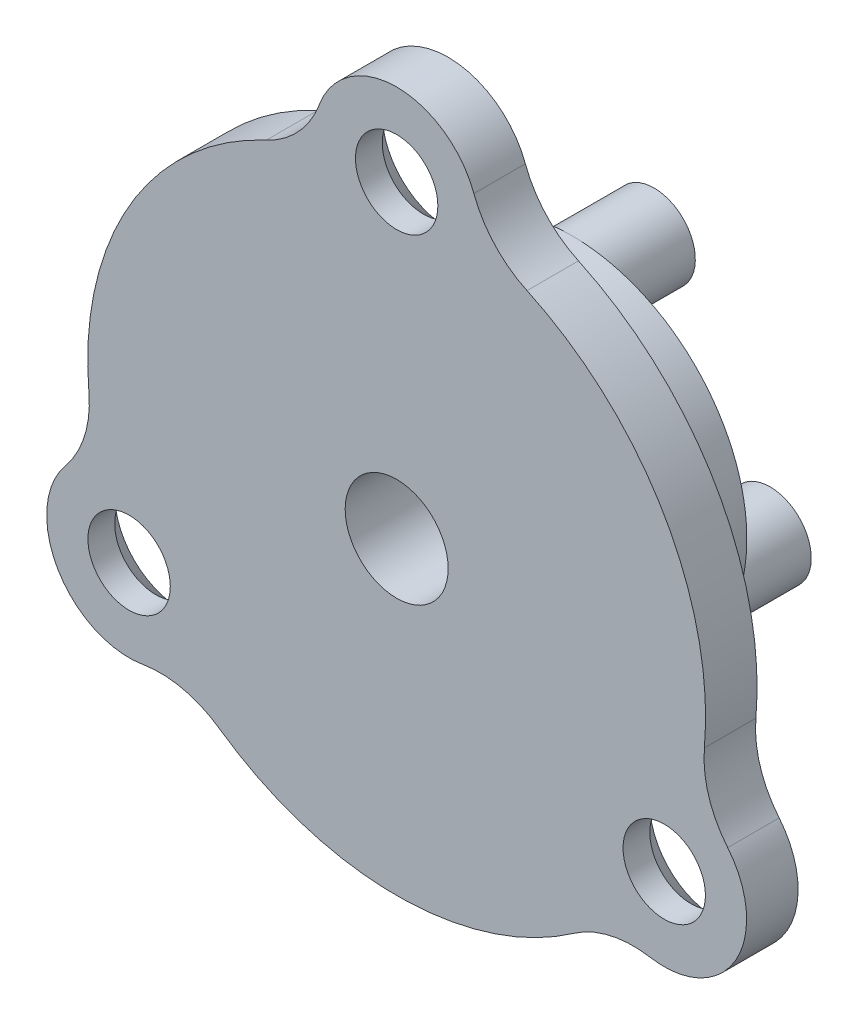
ISO-10303-21;
HEADER;
FILE_DESCRIPTION(('STEP AP214'),'2;1');
FILE_NAME('part.step','',(''),(''),'','','');
FILE_SCHEMA(('AUTOMOTIVE_DESIGN { 1 0 10303 214 1 1 1 1 }'));
ENDSEC;
DATA;
#1=APPLICATION_CONTEXT('core data for automotive mechanical design processes');
#2=APPLICATION_PROTOCOL_DEFINITION('international standard','automotive_design',2000,#1);
#3=PRODUCT_CONTEXT('',#1,'mechanical');
#4=PRODUCT('Part','Part','',(#3));
#5=PRODUCT_RELATED_PRODUCT_CATEGORY('part','',(#4));
#6=PRODUCT_DEFINITION_FORMATION('','',#4);
#7=PRODUCT_DEFINITION_CONTEXT('part definition',#1,'design');
#8=PRODUCT_DEFINITION('design','',#6,#7);
#9=PRODUCT_DEFINITION_SHAPE('','',#8);
#10=(LENGTH_UNIT() NAMED_UNIT(*) SI_UNIT(.MILLI.,.METRE.));
#11=(NAMED_UNIT(*) PLANE_ANGLE_UNIT() SI_UNIT($,.RADIAN.));
#12=(NAMED_UNIT(*) SI_UNIT($,.STERADIAN.) SOLID_ANGLE_UNIT());
#13=UNCERTAINTY_MEASURE_WITH_UNIT(LENGTH_MEASURE(1.E-05),#10,'distance_accuracy_value','');
#14=(GEOMETRIC_REPRESENTATION_CONTEXT(3) GLOBAL_UNCERTAINTY_ASSIGNED_CONTEXT((#13)) GLOBAL_UNIT_ASSIGNED_CONTEXT((#10,
#11,#12)) REPRESENTATION_CONTEXT('',''));
#15=CARTESIAN_POINT('',(0.,0.,0.));
#16=DIRECTION('',(0.,0.,1.));
#17=DIRECTION('',(1.,0.,0.));
#18=AXIS2_PLACEMENT_3D('',#15,#16,#17);
#19=CARTESIAN_POINT('',(0.,0.,0.));
#20=DIRECTION('',(0.,0.,1.));
#21=DIRECTION('',(1.,0.,0.));
#22=AXIS2_PLACEMENT_3D('',#19,#20,#21);
#23=PLANE('',#22);
#24=CARTESIAN_POINT('',(0.,0.,0.));
#25=DIRECTION('',(0.,0.,1.));
#26=DIRECTION('',(1.,0.,0.));
#27=AXIS2_PLACEMENT_3D('',#24,#25,#26);
#28=CIRCLE('',#27,9.25);
#29=CARTESIAN_POINT('',(9.25,0.,0.));
#30=VERTEX_POINT('',#29);
#31=EDGE_CURVE('E207',#30,#30,#28,.F.);
#32=ORIENTED_EDGE('',*,*,#31,.F.);
#33=EDGE_LOOP('',(#32));
#34=FACE_BOUND('',#33,.T.);
#35=CARTESIAN_POINT('',(0.,15.,0.));
#36=DIRECTION('',(0.,0.,1.));
#37=DIRECTION('',(1.,0.,0.));
#38=AXIS2_PLACEMENT_3D('',#35,#36,#37);
#39=CIRCLE('',#38,3.19999999999999);
#40=CARTESIAN_POINT('',(3.19999999999999,15.,0.));
#41=VERTEX_POINT('',#40);
#42=EDGE_CURVE('E210',#41,#41,#39,.T.);
#43=ORIENTED_EDGE('',*,*,#42,.T.);
#44=EDGE_LOOP('',(#43));
#45=FACE_BOUND('',#44,.T.);
#46=CARTESIAN_POINT('',(-12.9903810567647,-7.50000000000111,0.));
#47=DIRECTION('',(0.,0.,1.));
#48=DIRECTION('',(1.,0.,0.));
#49=AXIS2_PLACEMENT_3D('',#46,#47,#48);
#50=CIRCLE('',#49,3.19999999999999);
#51=CARTESIAN_POINT('',(-9.79038105676468,-7.50000000000111,0.));
#52=VERTEX_POINT('',#51);
#53=EDGE_CURVE('E213',#52,#52,#50,.T.);
#54=ORIENTED_EDGE('',*,*,#53,.T.);
#55=EDGE_LOOP('',(#54));
#56=FACE_BOUND('',#55,.T.);
#57=CARTESIAN_POINT('',(12.9903810567685,-7.49999999999889,0.));
#58=DIRECTION('',(0.,0.,1.));
#59=DIRECTION('',(1.,0.,0.));
#60=AXIS2_PLACEMENT_3D('',#57,#58,#59);
#61=CIRCLE('',#60,3.2);
#62=CARTESIAN_POINT('',(9.7903810567685,-7.49999999999889,0.));
#63=VERTEX_POINT('',#62);
#64=EDGE_CURVE('E216',#63,#63,#61,.T.);
#65=ORIENTED_EDGE('',*,*,#64,.T.);
#66=EDGE_LOOP('',(#65));
#67=FACE_BOUND('',#66,.T.);
#68=CARTESIAN_POINT('',(0.,15.,0.));
#69=DIRECTION('',(0.,0.,-1.));
#70=DIRECTION('',(-1.,0.,0.));
#71=AXIS2_PLACEMENT_3D('',#68,#69,#70);
#72=CIRCLE('',#71,4.);
#73=CARTESIAN_POINT('',(-3.74975810833929,16.3925925925926,0.));
#74=VERTEX_POINT('',#73);
#75=CARTESIAN_POINT('',(3.74975810833929,16.3925925925926,0.));
#76=VERTEX_POINT('',#75);
#77=EDGE_CURVE('E301',#74,#76,#72,.T.);
#78=ORIENTED_EDGE('',*,*,#77,.T.);
#79=CARTESIAN_POINT('',(8.4369557437634,18.1333333333333,0.));
#80=DIRECTION('',(0.,0.,1.));
#81=DIRECTION('',(1.,0.,0.));
#82=AXIS2_PLACEMENT_3D('',#79,#80,#81);
#83=CIRCLE('',#82,5.);
#84=CARTESIAN_POINT('',(6.32771680782255,13.6,0.));
#85=VERTEX_POINT('',#84);
#86=EDGE_CURVE('E279',#76,#85,#83,.T.);
#87=ORIENTED_EDGE('',*,*,#86,.T.);
#88=CARTESIAN_POINT('',(0.,0.,0.));
#89=DIRECTION('',(0.,0.,-1.));
#90=DIRECTION('',(-1.,0.,0.));
#91=AXIS2_PLACEMENT_3D('',#88,#89,#90);
#92=CIRCLE('',#91,15.);
#93=CARTESIAN_POINT('',(14.9418038953797,-1.32003649647074,0.));
#94=VERTEX_POINT('',#93);
#95=EDGE_CURVE('E402',#85,#94,#92,.T.);
#96=ORIENTED_EDGE('',*,*,#95,.T.);
#97=CARTESIAN_POINT('',(19.9224051938397,-1.76004866196099,0.));
#98=DIRECTION('',(0.,0.,1.));
#99=DIRECTION('',(1.,0.,0.));
#100=AXIS2_PLACEMENT_3D('',#97,#98,#99);
#101=CIRCLE('',#100,5.);
#102=CARTESIAN_POINT('',(16.0712806732441,-4.94891051642688,0.));
#103=VERTEX_POINT('',#102);
#104=EDGE_CURVE('E275',#94,#103,#101,.T.);
#105=ORIENTED_EDGE('',*,*,#104,.T.);
#106=CARTESIAN_POINT('',(12.9903810567685,-7.49999999999889,0.));
#107=DIRECTION('',(0.,0.,-1.));
#108=DIRECTION('',(-1.,0.,0.));
#109=AXIS2_PLACEMENT_3D('',#106,#107,#108);
#110=CIRCLE('',#109,3.99999999999889);
#111=CARTESIAN_POINT('',(12.3215225649066,-11.4436820761627,0.));
#112=VERTEX_POINT('',#111);
#113=EDGE_CURVE('E406',#103,#112,#110,.T.);
#114=ORIENTED_EDGE('',*,*,#113,.T.);
#115=CARTESIAN_POINT('',(11.4854494500791,-16.3732846713687,0.));
#116=DIRECTION('',(0.,0.,1.));
#117=DIRECTION('',(1.,0.,0.));
#118=AXIS2_PLACEMENT_3D('',#115,#116,#117);
#119=CIRCLE('',#118,5.);
#120=CARTESIAN_POINT('',(8.6140870875593,-12.2799635035266,0.));
#121=VERTEX_POINT('',#120);
#122=EDGE_CURVE('E271',#112,#121,#119,.T.);
#123=ORIENTED_EDGE('',*,*,#122,.T.);
#124=CARTESIAN_POINT('',(0.,0.,0.));
#125=DIRECTION('',(0.,0.,-1.));
#126=DIRECTION('',(-1.,0.,0.));
#127=AXIS2_PLACEMENT_3D('',#124,#125,#126);
#128=CIRCLE('',#127,15.);
#129=CARTESIAN_POINT('',(-8.61408708755489,-12.2799635035296,0.));
#130=VERTEX_POINT('',#129);
#131=EDGE_CURVE('E410',#121,#130,#128,.T.);
#132=ORIENTED_EDGE('',*,*,#131,.T.);
#133=CARTESIAN_POINT('',(-11.4854494500732,-16.3732846713729,0.));
#134=DIRECTION('',(0.,0.,1.));
#135=DIRECTION('',(1.,0.,0.));
#136=AXIS2_PLACEMENT_3D('',#133,#134,#135);
#137=CIRCLE('',#136,5.);
#138=CARTESIAN_POINT('',(-12.3215225649017,-11.4436820761669,0.));
#139=VERTEX_POINT('',#138);
#140=EDGE_CURVE('E267',#130,#139,#137,.T.);
#141=ORIENTED_EDGE('',*,*,#140,.T.);
#142=CARTESIAN_POINT('',(-12.9903810567647,-7.50000000000111,0.));
#143=DIRECTION('',(0.,0.,-1.));
#144=DIRECTION('',(-1.,0.,0.));
#145=AXIS2_PLACEMENT_3D('',#142,#143,#144);
#146=CIRCLE('',#145,4.0000000000011);
#147=CARTESIAN_POINT('',(-16.0712806732428,-4.94891051642869,0.));
#148=VERTEX_POINT('',#147);
#149=EDGE_CURVE('E293',#139,#148,#146,.T.);
#150=ORIENTED_EDGE('',*,*,#149,.T.);
#151=CARTESIAN_POINT('',(-19.9224051938394,-1.76004866196405,0.));
#152=DIRECTION('',(0.,0.,1.));
#153=DIRECTION('',(1.,0.,0.));
#154=AXIS2_PLACEMENT_3D('',#151,#152,#153);
#155=CIRCLE('',#154,5.);
#156=CARTESIAN_POINT('',(-14.9418038953795,-1.32003649647304,0.));
#157=VERTEX_POINT('',#156);
#158=EDGE_CURVE('E91',#148,#157,#155,.T.);
#159=ORIENTED_EDGE('',*,*,#158,.T.);
#160=CARTESIAN_POINT('',(0.,0.,0.));
#161=DIRECTION('',(0.,0.,-1.));
#162=DIRECTION('',(-1.,0.,0.));
#163=AXIS2_PLACEMENT_3D('',#160,#161,#162);
#164=CIRCLE('',#163,15.);
#165=CARTESIAN_POINT('',(-6.32771680782255,13.6,0.));
#166=VERTEX_POINT('',#165);
#167=EDGE_CURVE('E291',#157,#166,#164,.T.);
#168=ORIENTED_EDGE('',*,*,#167,.T.);
#169=CARTESIAN_POINT('',(-8.4369557437634,18.1333333333333,0.));
#170=DIRECTION('',(0.,0.,1.));
#171=DIRECTION('',(1.,0.,0.));
#172=AXIS2_PLACEMENT_3D('',#169,#170,#171);
#173=CIRCLE('',#172,5.);
#174=EDGE_CURVE('E283',#166,#74,#173,.T.);
#175=ORIENTED_EDGE('',*,*,#174,.T.);
#176=EDGE_LOOP('',(#78,#87,#96,#105,#114,#123,#132,#141,#150,#159,#168,#175));
#177=FACE_BOUND('',#176,.T.);
#178=ADVANCED_FACE('F83',(#34,#45,#56,#67,#177),#23,.F.);
#179=CARTESIAN_POINT('',(0.,0.,2.5));
#180=DIRECTION('',(0.,0.,1.));
#181=DIRECTION('',(1.,0.,0.));
#182=AXIS2_PLACEMENT_3D('',#179,#180,#181);
#183=PLANE('',#182);
#184=CARTESIAN_POINT('',(12.9903810567685,-7.49999999999889,2.5));
#185=DIRECTION('',(0.,0.,1.));
#186=DIRECTION('',(1.,0.,0.));
#187=AXIS2_PLACEMENT_3D('',#184,#185,#186);
#188=CIRCLE('',#187,2.);
#189=CARTESIAN_POINT('',(14.9903810567685,-7.49999999999889,2.5));
#190=VERTEX_POINT('',#189);
#191=EDGE_CURVE('E194',#190,#190,#188,.T.);
#192=ORIENTED_EDGE('',*,*,#191,.F.);
#193=EDGE_LOOP('',(#192));
#194=FACE_BOUND('',#193,.T.);
#195=CARTESIAN_POINT('',(0.,0.,2.5));
#196=DIRECTION('',(0.,0.,1.));
#197=DIRECTION('',(1.,0.,0.));
#198=AXIS2_PLACEMENT_3D('',#195,#196,#197);
#199=CIRCLE('',#198,2.5);
#200=CARTESIAN_POINT('',(2.5,0.,2.5));
#201=VERTEX_POINT('',#200);
#202=EDGE_CURVE('E204',#201,#201,#199,.T.);
#203=ORIENTED_EDGE('',*,*,#202,.F.);
#204=EDGE_LOOP('',(#203));
#205=FACE_BOUND('',#204,.T.);
#206=CARTESIAN_POINT('',(0.,15.,2.5));
#207=DIRECTION('',(0.,0.,1.));
#208=DIRECTION('',(1.,0.,0.));
#209=AXIS2_PLACEMENT_3D('',#206,#207,#208);
#210=CIRCLE('',#209,2.);
#211=CARTESIAN_POINT('',(2.,15.,2.5));
#212=VERTEX_POINT('',#211);
#213=EDGE_CURVE('E201',#212,#212,#210,.T.);
#214=ORIENTED_EDGE('',*,*,#213,.F.);
#215=EDGE_LOOP('',(#214));
#216=FACE_BOUND('',#215,.T.);
#217=CARTESIAN_POINT('',(-12.9903810567647,-7.50000000000111,2.5));
#218=DIRECTION('',(0.,0.,1.));
#219=DIRECTION('',(1.,0.,0.));
#220=AXIS2_PLACEMENT_3D('',#217,#218,#219);
#221=CIRCLE('',#220,2.);
#222=CARTESIAN_POINT('',(-10.9903810567647,-7.50000000000111,2.5));
#223=VERTEX_POINT('',#222);
#224=EDGE_CURVE('E192',#223,#223,#221,.T.);
#225=ORIENTED_EDGE('',*,*,#224,.F.);
#226=EDGE_LOOP('',(#225));
#227=FACE_BOUND('',#226,.T.);
#228=CARTESIAN_POINT('',(0.,0.,2.5));
#229=DIRECTION('',(0.,0.,1.));
#230=DIRECTION('',(1.,0.,0.));
#231=AXIS2_PLACEMENT_3D('',#228,#229,#230);
#232=CIRCLE('',#231,15.);
#233=CARTESIAN_POINT('',(-8.61408708755489,-12.2799635035296,2.5));
#234=VERTEX_POINT('',#233);
#235=CARTESIAN_POINT('',(8.6140870875593,-12.2799635035266,2.5));
#236=VERTEX_POINT('',#235);
#237=EDGE_CURVE('E231',#234,#236,#232,.T.);
#238=ORIENTED_EDGE('',*,*,#237,.T.);
#239=CARTESIAN_POINT('',(11.4854494500791,-16.3732846713687,2.5));
#240=DIRECTION('',(0.,0.,1.));
#241=DIRECTION('',(1.,0.,0.));
#242=AXIS2_PLACEMENT_3D('',#239,#240,#241);
#243=CIRCLE('',#242,5.);
#244=CARTESIAN_POINT('',(12.3215225649066,-11.4436820761627,2.5));
#245=VERTEX_POINT('',#244);
#246=EDGE_CURVE('E273',#236,#245,#243,.F.);
#247=ORIENTED_EDGE('',*,*,#246,.T.);
#248=CARTESIAN_POINT('',(12.9903810567685,-7.49999999999889,2.5));
#249=DIRECTION('',(0.,0.,1.));
#250=DIRECTION('',(1.,0.,0.));
#251=AXIS2_PLACEMENT_3D('',#248,#249,#250);
#252=CIRCLE('',#251,3.99999999999889);
#253=CARTESIAN_POINT('',(16.0712806732441,-4.94891051642688,2.5));
#254=VERTEX_POINT('',#253);
#255=EDGE_CURVE('E417',#245,#254,#252,.T.);
#256=ORIENTED_EDGE('',*,*,#255,.T.);
#257=CARTESIAN_POINT('',(19.9224051938397,-1.76004866196099,2.5));
#258=DIRECTION('',(0.,0.,1.));
#259=DIRECTION('',(1.,0.,0.));
#260=AXIS2_PLACEMENT_3D('',#257,#258,#259);
#261=CIRCLE('',#260,5.);
#262=CARTESIAN_POINT('',(14.9418038953797,-1.32003649647074,2.5));
#263=VERTEX_POINT('',#262);
#264=EDGE_CURVE('E277',#254,#263,#261,.F.);
#265=ORIENTED_EDGE('',*,*,#264,.T.);
#266=CARTESIAN_POINT('',(0.,0.,2.5));
#267=DIRECTION('',(0.,0.,1.));
#268=DIRECTION('',(1.,0.,0.));
#269=AXIS2_PLACEMENT_3D('',#266,#267,#268);
#270=CIRCLE('',#269,15.);
#271=CARTESIAN_POINT('',(6.32771680782255,13.6,2.5));
#272=VERTEX_POINT('',#271);
#273=EDGE_CURVE('E234',#263,#272,#270,.T.);
#274=ORIENTED_EDGE('',*,*,#273,.T.);
#275=CARTESIAN_POINT('',(8.4369557437634,18.1333333333333,2.5));
#276=DIRECTION('',(0.,0.,1.));
#277=DIRECTION('',(1.,0.,0.));
#278=AXIS2_PLACEMENT_3D('',#275,#276,#277);
#279=CIRCLE('',#278,5.);
#280=CARTESIAN_POINT('',(3.74975810833929,16.3925925925926,2.5));
#281=VERTEX_POINT('',#280);
#282=EDGE_CURVE('E281',#272,#281,#279,.F.);
#283=ORIENTED_EDGE('',*,*,#282,.T.);
#284=CARTESIAN_POINT('',(0.,15.,2.5));
#285=DIRECTION('',(0.,0.,1.));
#286=DIRECTION('',(1.,0.,0.));
#287=AXIS2_PLACEMENT_3D('',#284,#285,#286);
#288=CIRCLE('',#287,4.);
#289=CARTESIAN_POINT('',(-3.74975810833929,16.3925925925926,2.5));
#290=VERTEX_POINT('',#289);
#291=EDGE_CURVE('E313',#281,#290,#288,.T.);
#292=ORIENTED_EDGE('',*,*,#291,.T.);
#293=CARTESIAN_POINT('',(-8.4369557437634,18.1333333333333,2.5));
#294=DIRECTION('',(0.,0.,1.));
#295=DIRECTION('',(1.,0.,0.));
#296=AXIS2_PLACEMENT_3D('',#293,#294,#295);
#297=CIRCLE('',#296,5.);
#298=CARTESIAN_POINT('',(-6.32771680782255,13.6,2.5));
#299=VERTEX_POINT('',#298);
#300=EDGE_CURVE('E285',#290,#299,#297,.F.);
#301=ORIENTED_EDGE('',*,*,#300,.T.);
#302=CARTESIAN_POINT('',(0.,0.,2.5));
#303=DIRECTION('',(0.,0.,1.));
#304=DIRECTION('',(1.,0.,0.));
#305=AXIS2_PLACEMENT_3D('',#302,#303,#304);
#306=CIRCLE('',#305,15.);
#307=CARTESIAN_POINT('',(-14.9418038953795,-1.32003649647304,2.5));
#308=VERTEX_POINT('',#307);
#309=EDGE_CURVE('E228',#299,#308,#306,.T.);
#310=ORIENTED_EDGE('',*,*,#309,.T.);
#311=CARTESIAN_POINT('',(-19.9224051938394,-1.76004866196405,2.5));
#312=DIRECTION('',(0.,0.,1.));
#313=DIRECTION('',(1.,0.,0.));
#314=AXIS2_PLACEMENT_3D('',#311,#312,#313);
#315=CIRCLE('',#314,5.);
#316=CARTESIAN_POINT('',(-16.0712806732428,-4.94891051642869,2.5));
#317=VERTEX_POINT('',#316);
#318=EDGE_CURVE('E12',#308,#317,#315,.F.);
#319=ORIENTED_EDGE('',*,*,#318,.T.);
#320=CARTESIAN_POINT('',(-12.9903810567647,-7.50000000000111,2.5));
#321=DIRECTION('',(0.,0.,1.));
#322=DIRECTION('',(1.,0.,0.));
#323=AXIS2_PLACEMENT_3D('',#320,#321,#322);
#324=CIRCLE('',#323,4.0000000000011);
#325=CARTESIAN_POINT('',(-12.3215225649017,-11.4436820761669,2.5));
#326=VERTEX_POINT('',#325);
#327=EDGE_CURVE('E308',#317,#326,#324,.T.);
#328=ORIENTED_EDGE('',*,*,#327,.T.);
#329=CARTESIAN_POINT('',(-11.4854494500732,-16.3732846713729,2.5));
#330=DIRECTION('',(0.,0.,1.));
#331=DIRECTION('',(1.,0.,0.));
#332=AXIS2_PLACEMENT_3D('',#329,#330,#331);
#333=CIRCLE('',#332,5.);
#334=EDGE_CURVE('E269',#326,#234,#333,.F.);
#335=ORIENTED_EDGE('',*,*,#334,.T.);
#336=EDGE_LOOP('',(#238,#247,#256,#265,#274,#283,#292,#301,#310,#319,#328,#335));
#337=FACE_BOUND('',#336,.T.);
#338=ADVANCED_FACE('F307',(#194,#205,#216,#227,#337),#183,.T.);
#339=CARTESIAN_POINT('',(0.,0.,2.5));
#340=DIRECTION('',(0.,0.,-1.));
#341=DIRECTION('',(-1.,0.,0.));
#342=AXIS2_PLACEMENT_3D('',#339,#340,#341);
#343=CYLINDRICAL_SURFACE('',#342,2.5);
#344=ORIENTED_EDGE('',*,*,#202,.T.);
#345=EDGE_LOOP('',(#344));
#346=FACE_BOUND('',#345,.T.);
#347=CARTESIAN_POINT('',(0.,0.,-6.));
#348=DIRECTION('',(0.,0.,-1.));
#349=DIRECTION('',(-1.,0.,0.));
#350=AXIS2_PLACEMENT_3D('',#347,#348,#349);
#351=CIRCLE('',#350,2.5);
#352=CARTESIAN_POINT('',(-2.5,0.,-6.));
#353=VERTEX_POINT('',#352);
#354=EDGE_CURVE('E188',#353,#353,#351,.T.);
#355=ORIENTED_EDGE('',*,*,#354,.T.);
#356=EDGE_LOOP('',(#355));
#357=FACE_BOUND('',#356,.T.);
#358=ADVANCED_FACE('F328',(#346,#357),#343,.F.);
#359=CARTESIAN_POINT('',(0.,15.,2.5));
#360=DIRECTION('',(0.,0.,-1.));
#361=DIRECTION('',(-1.,0.,0.));
#362=AXIS2_PLACEMENT_3D('',#359,#360,#361);
#363=CYLINDRICAL_SURFACE('',#362,2.);
#364=CARTESIAN_POINT('',(0.,15.,1.19999999999999));
#365=DIRECTION('',(0.,0.,1.));
#366=DIRECTION('',(1.,0.,0.));
#367=AXIS2_PLACEMENT_3D('',#364,#365,#366);
#368=CIRCLE('',#367,2.);
#369=CARTESIAN_POINT('',(2.,15.,1.19999999999999));
#370=VERTEX_POINT('',#369);
#371=EDGE_CURVE('E225',#370,#370,#368,.F.);
#372=ORIENTED_EDGE('',*,*,#371,.T.);
#373=EDGE_LOOP('',(#372));
#374=FACE_BOUND('',#373,.T.);
#375=ORIENTED_EDGE('',*,*,#213,.T.);
#376=EDGE_LOOP('',(#375));
#377=FACE_BOUND('',#376,.T.);
#378=ADVANCED_FACE('F660',(#374,#377),#363,.F.);
#379=CARTESIAN_POINT('',(12.9903810567685,-7.49999999999889,2.5));
#380=DIRECTION('',(0.,0.,-1.));
#381=DIRECTION('',(-1.,0.,0.));
#382=AXIS2_PLACEMENT_3D('',#379,#380,#381);
#383=CYLINDRICAL_SURFACE('',#382,2.);
#384=CARTESIAN_POINT('',(12.9903810567685,-7.49999999999889,1.2));
#385=DIRECTION('',(0.,0.,1.));
#386=DIRECTION('',(1.,0.,0.));
#387=AXIS2_PLACEMENT_3D('',#384,#385,#386);
#388=CIRCLE('',#387,2.);
#389=CARTESIAN_POINT('',(10.9903810567685,-7.49999999999889,1.2));
#390=VERTEX_POINT('',#389);
#391=EDGE_CURVE('E219',#390,#390,#388,.F.);
#392=ORIENTED_EDGE('',*,*,#391,.T.);
#393=EDGE_LOOP('',(#392));
#394=FACE_BOUND('',#393,.T.);
#395=ORIENTED_EDGE('',*,*,#191,.T.);
#396=EDGE_LOOP('',(#395));
#397=FACE_BOUND('',#396,.T.);
#398=ADVANCED_FACE('F339',(#394,#397),#383,.F.);
#399=CARTESIAN_POINT('',(-12.9903810567647,-7.50000000000111,2.5));
#400=DIRECTION('',(0.,0.,-1.));
#401=DIRECTION('',(-1.,0.,0.));
#402=AXIS2_PLACEMENT_3D('',#399,#400,#401);
#403=CYLINDRICAL_SURFACE('',#402,2.);
#404=CARTESIAN_POINT('',(-12.9903810567647,-7.50000000000111,1.2));
#405=DIRECTION('',(0.,0.,1.));
#406=DIRECTION('',(1.,0.,0.));
#407=AXIS2_PLACEMENT_3D('',#404,#405,#406);
#408=CIRCLE('',#407,2.);
#409=CARTESIAN_POINT('',(-10.9903810567647,-7.50000000000111,1.2));
#410=VERTEX_POINT('',#409);
#411=EDGE_CURVE('E222',#410,#410,#408,.F.);
#412=ORIENTED_EDGE('',*,*,#411,.T.);
#413=EDGE_LOOP('',(#412));
#414=FACE_BOUND('',#413,.T.);
#415=ORIENTED_EDGE('',*,*,#224,.T.);
#416=EDGE_LOOP('',(#415));
#417=FACE_BOUND('',#416,.T.);
#418=ADVANCED_FACE('F330',(#414,#417),#403,.F.);
#419=CARTESIAN_POINT('',(0.,0.,-6.));
#420=DIRECTION('',(0.,0.,-1.));
#421=DIRECTION('',(-1.,0.,0.));
#422=AXIS2_PLACEMENT_3D('',#419,#420,#421);
#423=PLANE('',#422);
#424=CARTESIAN_POINT('',(0.,0.,-6.));
#425=DIRECTION('',(0.,0.,-1.));
#426=DIRECTION('',(-1.,0.,0.));
#427=AXIS2_PLACEMENT_3D('',#424,#425,#426);
#428=CIRCLE('',#427,8.5);
#429=CARTESIAN_POINT('',(0.,8.5,-6.));
#430=VERTEX_POINT('',#429);
#431=CARTESIAN_POINT('',(7.36121593216773,-4.25,-6.));
#432=VERTEX_POINT('',#431);
#433=EDGE_CURVE('E190',#430,#432,#428,.T.);
#434=ORIENTED_EDGE('',*,*,#433,.T.);
#435=CARTESIAN_POINT('',(5.62916512459885,-3.25,-6.));
#436=DIRECTION('',(0.,0.,-1.));
#437=DIRECTION('',(-1.,0.,0.));
#438=AXIS2_PLACEMENT_3D('',#435,#436,#437);
#439=CIRCLE('',#438,2.);
#440=EDGE_CURVE('E96',#432,#432,#439,.T.);
#441=ORIENTED_EDGE('',*,*,#440,.F.);
#442=CARTESIAN_POINT('',(-7.36121593216773,-4.25,-6.));
#443=VERTEX_POINT('',#442);
#444=EDGE_CURVE('E102',#432,#443,#428,.T.);
#445=ORIENTED_EDGE('',*,*,#444,.T.);
#446=CARTESIAN_POINT('',(-5.62916512459885,-3.25,-6.));
#447=DIRECTION('',(0.,0.,-1.));
#448=DIRECTION('',(-1.,0.,0.));
#449=AXIS2_PLACEMENT_3D('',#446,#447,#448);
#450=CIRCLE('',#449,2.);
#451=EDGE_CURVE('E186',#443,#443,#450,.T.);
#452=ORIENTED_EDGE('',*,*,#451,.F.);
#453=EDGE_CURVE('E179',#443,#430,#428,.T.);
#454=ORIENTED_EDGE('',*,*,#453,.T.);
#455=CARTESIAN_POINT('',(0.,6.5,-6.));
#456=DIRECTION('',(0.,0.,-1.));
#457=DIRECTION('',(-1.,0.,0.));
#458=AXIS2_PLACEMENT_3D('',#455,#456,#457);
#459=CIRCLE('',#458,2.);
#460=EDGE_CURVE('E185',#430,#430,#459,.T.);
#461=ORIENTED_EDGE('',*,*,#460,.F.);
#462=EDGE_LOOP('',(#434,#441,#445,#452,#454,#461));
#463=FACE_BOUND('',#462,.T.);
#464=ORIENTED_EDGE('',*,*,#354,.F.);
#465=EDGE_LOOP('',(#464));
#466=FACE_BOUND('',#465,.T.);
#467=ADVANCED_FACE('F182',(#463,#466),#423,.T.);
#468=CARTESIAN_POINT('',(0.,0.,-6.));
#469=DIRECTION('',(0.,0.,1.));
#470=DIRECTION('',(1.,0.,0.));
#471=AXIS2_PLACEMENT_3D('',#468,#469,#470);
#472=CYLINDRICAL_SURFACE('',#471,8.5);
#473=CARTESIAN_POINT('',(0.,0.,-0.5));
#474=DIRECTION('',(0.,0.,-1.));
#475=DIRECTION('',(-1.,0.,0.));
#476=AXIS2_PLACEMENT_3D('',#473,#474,#475);
#477=CIRCLE('',#476,8.5);
#478=CARTESIAN_POINT('',(-8.5,0.,-0.5));
#479=VERTEX_POINT('',#478);
#480=EDGE_CURVE('E316',#479,#479,#477,.T.);
#481=ORIENTED_EDGE('',*,*,#480,.T.);
#482=EDGE_LOOP('',(#481));
#483=FACE_BOUND('',#482,.T.);
#484=ORIENTED_EDGE('',*,*,#433,.F.);
#485=ORIENTED_EDGE('',*,*,#453,.F.);
#486=ORIENTED_EDGE('',*,*,#444,.F.);
#487=EDGE_LOOP('',(#484,#485,#486));
#488=FACE_BOUND('',#487,.T.);
#489=ADVANCED_FACE('F191',(#483,#488),#472,.T.);
#490=CARTESIAN_POINT('',(0.,0.,-0.5));
#491=DIRECTION('',(0.,0.,-1.));
#492=DIRECTION('',(-1.,0.,0.));
#493=AXIS2_PLACEMENT_3D('',#490,#491,#492);
#494=PLANE('',#493);
#495=CARTESIAN_POINT('',(0.,0.,-0.5));
#496=DIRECTION('',(0.,0.,-1.));
#497=DIRECTION('',(-1.,0.,0.));
#498=AXIS2_PLACEMENT_3D('',#495,#496,#497);
#499=CIRCLE('',#498,9.25);
#500=CARTESIAN_POINT('',(-9.25,0.,-0.5));
#501=VERTEX_POINT('',#500);
#502=EDGE_CURVE('E321',#501,#501,#499,.T.);
#503=ORIENTED_EDGE('',*,*,#502,.T.);
#504=EDGE_LOOP('',(#503));
#505=FACE_BOUND('',#504,.T.);
#506=ORIENTED_EDGE('',*,*,#480,.F.);
#507=EDGE_LOOP('',(#506));
#508=FACE_BOUND('',#507,.T.);
#509=ADVANCED_FACE('F336',(#505,#508),#494,.T.);
#510=CARTESIAN_POINT('',(0.,0.,-0.5));
#511=DIRECTION('',(0.,0.,1.));
#512=DIRECTION('',(1.,0.,0.));
#513=AXIS2_PLACEMENT_3D('',#510,#511,#512);
#514=CYLINDRICAL_SURFACE('',#513,9.25);
#515=ORIENTED_EDGE('',*,*,#502,.F.);
#516=EDGE_LOOP('',(#515));
#517=FACE_BOUND('',#516,.T.);
#518=ORIENTED_EDGE('',*,*,#31,.T.);
#519=EDGE_LOOP('',(#518));
#520=FACE_BOUND('',#519,.T.);
#521=ADVANCED_FACE('F359',(#517,#520),#514,.T.);
#522=CARTESIAN_POINT('',(12.9903810567685,-7.49999999999889,0.));
#523=DIRECTION('',(0.,0.,-1.));
#524=DIRECTION('',(-1.,0.,0.));
#525=AXIS2_PLACEMENT_3D('',#522,#523,#524);
#526=CONICAL_SURFACE('',#525,3.2,0.785398163397447);
#527=CARTESIAN_POINT('',(10.9903810567685,-7.49999999999889,1.2));
#528=CARTESIAN_POINT('',(10.9778810567685,-7.49999999999889,1.1875));
#529=CARTESIAN_POINT('',(10.9653810567685,-7.49999999999889,1.175));
#530=CARTESIAN_POINT('',(10.9403810567685,-7.49999999999889,1.15));
#531=CARTESIAN_POINT('',(10.9278810567685,-7.49999999999889,1.1375));
#532=CARTESIAN_POINT('',(10.9028810567685,-7.49999999999889,1.1125));
#533=CARTESIAN_POINT('',(10.8903810567685,-7.49999999999889,1.1));
#534=CARTESIAN_POINT('',(10.8653810567685,-7.49999999999889,1.075));
#535=CARTESIAN_POINT('',(10.8528810567685,-7.49999999999889,1.0625));
#536=CARTESIAN_POINT('',(10.8278810567685,-7.49999999999889,1.0375));
#537=CARTESIAN_POINT('',(10.8153810567685,-7.49999999999889,1.025));
#538=CARTESIAN_POINT('',(10.7903810567685,-7.49999999999889,1.));
#539=CARTESIAN_POINT('',(10.7778810567685,-7.49999999999889,0.987500000000004));
#540=CARTESIAN_POINT('',(10.7528810567685,-7.49999999999889,0.962500000000003));
#541=CARTESIAN_POINT('',(10.7403810567685,-7.49999999999889,0.950000000000004));
#542=CARTESIAN_POINT('',(10.7153810567685,-7.49999999999889,0.925000000000003));
#543=CARTESIAN_POINT('',(10.7028810567685,-7.49999999999889,0.912500000000003));
#544=CARTESIAN_POINT('',(10.6778810567685,-7.49999999999889,0.887500000000003));
#545=CARTESIAN_POINT('',(10.6653810567685,-7.49999999999889,0.875000000000003));
#546=CARTESIAN_POINT('',(10.6403810567685,-7.49999999999889,0.850000000000003));
#547=CARTESIAN_POINT('',(10.6278810567685,-7.49999999999889,0.837500000000003));
#548=CARTESIAN_POINT('',(10.6028810567685,-7.49999999999889,0.812500000000003));
#549=CARTESIAN_POINT('',(10.5903810567685,-7.49999999999889,0.800000000000003));
#550=CARTESIAN_POINT('',(10.5653810567685,-7.49999999999889,0.775000000000003));
#551=CARTESIAN_POINT('',(10.5528810567685,-7.49999999999889,0.762500000000003));
#552=CARTESIAN_POINT('',(10.5278810567685,-7.49999999999889,0.737500000000003));
#553=CARTESIAN_POINT('',(10.5153810567685,-7.49999999999889,0.725000000000003));
#554=CARTESIAN_POINT('',(10.4903810567685,-7.49999999999889,0.700000000000002));
#555=CARTESIAN_POINT('',(10.4778810567685,-7.49999999999889,0.687500000000002));
#556=CARTESIAN_POINT('',(10.4528810567685,-7.49999999999889,0.662500000000002));
#557=CARTESIAN_POINT('',(10.4403810567685,-7.49999999999889,0.650000000000002));
#558=CARTESIAN_POINT('',(10.4153810567685,-7.49999999999889,0.625000000000002));
#559=CARTESIAN_POINT('',(10.4028810567685,-7.49999999999889,0.612500000000002));
#560=CARTESIAN_POINT('',(10.3778810567685,-7.49999999999889,0.587500000000002));
#561=CARTESIAN_POINT('',(10.3653810567685,-7.49999999999889,0.575000000000002));
#562=CARTESIAN_POINT('',(10.3403810567685,-7.49999999999889,0.550000000000002));
#563=CARTESIAN_POINT('',(10.3278810567685,-7.49999999999889,0.537500000000002));
#564=CARTESIAN_POINT('',(10.3028810567685,-7.49999999999889,0.512500000000002));
#565=CARTESIAN_POINT('',(10.2903810567685,-7.49999999999889,0.500000000000002));
#566=CARTESIAN_POINT('',(10.2653810567685,-7.49999999999889,0.475000000000002));
#567=CARTESIAN_POINT('',(10.2528810567685,-7.49999999999889,0.462500000000002));
#568=CARTESIAN_POINT('',(10.2278810567685,-7.49999999999889,0.437500000000002));
#569=CARTESIAN_POINT('',(10.2153810567685,-7.49999999999889,0.425000000000002));
#570=CARTESIAN_POINT('',(10.1903810567685,-7.49999999999889,0.400000000000002));
#571=CARTESIAN_POINT('',(10.1778810567685,-7.49999999999889,0.387500000000002));
#572=CARTESIAN_POINT('',(10.1528810567685,-7.49999999999889,0.362500000000001));
#573=CARTESIAN_POINT('',(10.1403810567685,-7.49999999999889,0.350000000000001));
#574=CARTESIAN_POINT('',(10.1153810567685,-7.49999999999889,0.325000000000001));
#575=CARTESIAN_POINT('',(10.1028810567685,-7.49999999999889,0.312500000000001));
#576=CARTESIAN_POINT('',(10.0778810567685,-7.49999999999889,0.287500000000001));
#577=CARTESIAN_POINT('',(10.0653810567685,-7.49999999999889,0.275000000000001));
#578=CARTESIAN_POINT('',(10.0403810567685,-7.49999999999889,0.250000000000001));
#579=CARTESIAN_POINT('',(10.0278810567685,-7.49999999999889,0.237500000000001));
#580=CARTESIAN_POINT('',(10.0028810567685,-7.49999999999889,0.212500000000001));
#581=CARTESIAN_POINT('',(9.9903810567685,-7.49999999999889,0.200000000000001));
#582=CARTESIAN_POINT('',(9.9653810567685,-7.49999999999889,0.175));
#583=CARTESIAN_POINT('',(9.9528810567685,-7.49999999999889,0.1625));
#584=CARTESIAN_POINT('',(9.9278810567685,-7.49999999999889,0.1375));
#585=CARTESIAN_POINT('',(9.9153810567685,-7.49999999999889,0.125000000000001));
#586=CARTESIAN_POINT('',(9.8903810567685,-7.49999999999889,0.1));
#587=CARTESIAN_POINT('',(9.8778810567685,-7.49999999999889,0.0875000000000001));
#588=CARTESIAN_POINT('',(9.8528810567685,-7.49999999999889,0.0625));
#589=CARTESIAN_POINT('',(9.8403810567685,-7.49999999999889,0.0500000000000002));
#590=CARTESIAN_POINT('',(9.8153810567685,-7.49999999999889,0.0250000000000005));
#591=CARTESIAN_POINT('',(9.80288105676849,-7.49999999999889,0.0125000000000006));
#592=CARTESIAN_POINT('',(9.7903810567685,-7.49999999999889,0.));
#593=B_SPLINE_CURVE_WITH_KNOTS('',3,(#527,#528,#529,#530,#531,#532,#533,#534,#535,#536,#537,
#538,#539,#540,#541,#542,#543,#544,#545,#546,#547,#548,#549,#550,#551,#552,#553,#554,#555,#556,
#557,#558,#559,#560,#561,#562,#563,#564,#565,#566,#567,#568,#569,#570,#571,#572,#573,#574,#575,
#576,#577,#578,#579,#580,#581,#582,#583,#584,#585,#586,#587,#588,#589,#590,#591,#592),
.UNSPECIFIED.,.F.,.F.,(4,2,2,2,2,2,2,2,2,2,2,2,2,2,2,2,2,2,2,2,2,2,2,2,2,2,2,2,2,2,2,2,4),(0.,
0.053033008588992,0.106066017177984,0.159099025766975,0.212132034355965,0.265165042944956,
0.318198051533948,0.37123106012294,0.42426406871193,0.477297077300921,0.530330085889913,
0.583363094478904,0.636396103067896,0.689429111656886,0.742462120245877,0.795495128834869,
0.84852813742386,0.901561146012852,0.954594154601842,1.00762716319083,1.06066017177982,
1.11369318036882,1.16672618895781,1.2197591975468,1.27279220613579,1.32582521472478,
1.37885822331377,1.43189123190276,1.48492424049175,1.53795724908075,1.59099025766974,
1.64402326625873,1.69705627484772),.UNSPECIFIED.);
#594=EDGE_CURVE('BSEAM355',#390,#63,#593,.T.);
#595=ORIENTED_EDGE('',*,*,#391,.F.);
#596=ORIENTED_EDGE('',*,*,#64,.F.);
#597=ORIENTED_EDGE('',*,*,#594,.T.);
#598=ORIENTED_EDGE('',*,*,#594,.F.);
#599=EDGE_LOOP('',(#595,#597,#596,#598));
#600=FACE_BOUND('',#599,.T.);
#601=ADVANCED_FACE('F355',(#600),#526,.F.);
#602=CARTESIAN_POINT('',(-12.9903810567647,-7.50000000000111,0.));
#603=DIRECTION('',(0.,0.,-1.));
#604=DIRECTION('',(-1.,0.,0.));
#605=AXIS2_PLACEMENT_3D('',#602,#603,#604);
#606=CONICAL_SURFACE('',#605,3.19999999999999,0.785398163397444);
#607=ORIENTED_EDGE('',*,*,#411,.F.);
#608=EDGE_LOOP('',(#607));
#609=FACE_BOUND('',#608,.T.);
#610=ORIENTED_EDGE('',*,*,#53,.F.);
#611=EDGE_LOOP('',(#610));
#612=FACE_BOUND('',#611,.T.);
#613=ADVANCED_FACE('F358',(#609,#612),#606,.F.);
#614=CARTESIAN_POINT('',(0.,15.,0.));
#615=DIRECTION('',(0.,0.,-1.));
#616=DIRECTION('',(-1.,0.,0.));
#617=AXIS2_PLACEMENT_3D('',#614,#615,#616);
#618=CONICAL_SURFACE('',#617,3.19999999999999,0.785398163397449);
#619=ORIENTED_EDGE('',*,*,#371,.F.);
#620=EDGE_LOOP('',(#619));
#621=FACE_BOUND('',#620,.T.);
#622=ORIENTED_EDGE('',*,*,#42,.F.);
#623=EDGE_LOOP('',(#622));
#624=FACE_BOUND('',#623,.T.);
#625=ADVANCED_FACE('F363',(#621,#624),#618,.F.);
#626=CARTESIAN_POINT('',(0.,15.,10.));
#627=DIRECTION('',(0.,0.,-1.));
#628=DIRECTION('',(-1.,0.,0.));
#629=AXIS2_PLACEMENT_3D('',#626,#627,#628);
#630=CYLINDRICAL_SURFACE('',#629,4.);
#631=ORIENTED_EDGE('',*,*,#291,.F.);
#632=DIRECTION('',(0.,0.,-1.));
#633=VECTOR('',#632,1.);
#634=CARTESIAN_POINT('',(3.74975810833929,16.3925925925926,10.));
#635=LINE('',#634,#633);
#636=EDGE_CURVE('E259',#281,#76,#635,.T.);
#637=ORIENTED_EDGE('',*,*,#636,.T.);
#638=ORIENTED_EDGE('',*,*,#77,.F.);
#639=DIRECTION('',(0.,0.,-1.));
#640=VECTOR('',#639,1.);
#641=CARTESIAN_POINT('',(-3.74975810833929,16.3925925925926,10.));
#642=LINE('',#641,#640);
#643=EDGE_CURVE('E257',#74,#290,#642,.F.);
#644=ORIENTED_EDGE('',*,*,#643,.T.);
#645=EDGE_LOOP('',(#631,#637,#638,#644));
#646=FACE_BOUND('',#645,.T.);
#647=ADVANCED_FACE('F367',(#646),#630,.T.);
#648=CARTESIAN_POINT('',(-12.9903810567647,-7.50000000000111,10.));
#649=DIRECTION('',(0.,0.,-1.));
#650=DIRECTION('',(-1.,0.,0.));
#651=AXIS2_PLACEMENT_3D('',#648,#649,#650);
#652=CYLINDRICAL_SURFACE('',#651,4.0000000000011);
#653=ORIENTED_EDGE('',*,*,#149,.F.);
#654=DIRECTION('',(0.,0.,-1.));
#655=VECTOR('',#654,1.);
#656=CARTESIAN_POINT('',(-12.3215225649017,-11.4436820761669,10.));
#657=LINE('',#656,#655);
#658=EDGE_CURVE('E245',#139,#326,#657,.F.);
#659=ORIENTED_EDGE('',*,*,#658,.T.);
#660=ORIENTED_EDGE('',*,*,#327,.F.);
#661=DIRECTION('',(0.,0.,-1.));
#662=VECTOR('',#661,1.);
#663=CARTESIAN_POINT('',(-16.0712806732428,-4.94891051642869,10.));
#664=LINE('',#663,#662);
#665=EDGE_CURVE('E242',#317,#148,#664,.T.);
#666=ORIENTED_EDGE('',*,*,#665,.T.);
#667=EDGE_LOOP('',(#653,#659,#660,#666));
#668=FACE_BOUND('',#667,.T.);
#669=ADVANCED_FACE('F311',(#668),#652,.T.);
#670=CARTESIAN_POINT('',(0.,0.,10.));
#671=DIRECTION('',(0.,0.,-1.));
#672=DIRECTION('',(-1.,0.,0.));
#673=AXIS2_PLACEMENT_3D('',#670,#671,#672);
#674=CYLINDRICAL_SURFACE('',#673,15.);
#675=ORIENTED_EDGE('',*,*,#309,.F.);
#676=DIRECTION('',(0.,0.,-1.));
#677=VECTOR('',#676,1.);
#678=CARTESIAN_POINT('',(-6.32771680782255,13.6,10.));
#679=LINE('',#678,#677);
#680=EDGE_CURVE('E264',#299,#166,#679,.T.);
#681=ORIENTED_EDGE('',*,*,#680,.T.);
#682=ORIENTED_EDGE('',*,*,#167,.F.);
#683=DIRECTION('',(0.,0.,-1.));
#684=VECTOR('',#683,1.);
#685=CARTESIAN_POINT('',(-14.9418038953795,-1.32003649647304,10.));
#686=LINE('',#685,#684);
#687=EDGE_CURVE('E262',#157,#308,#686,.F.);
#688=ORIENTED_EDGE('',*,*,#687,.T.);
#689=EDGE_LOOP('',(#675,#681,#682,#688));
#690=FACE_BOUND('',#689,.T.);
#691=ADVANCED_FACE('F299',(#690),#674,.T.);
#692=CARTESIAN_POINT('',(12.9903810567685,-7.49999999999889,10.));
#693=DIRECTION('',(0.,0.,-1.));
#694=DIRECTION('',(-1.,0.,0.));
#695=AXIS2_PLACEMENT_3D('',#692,#693,#694);
#696=CYLINDRICAL_SURFACE('',#695,3.99999999999889);
#697=ORIENTED_EDGE('',*,*,#255,.F.);
#698=DIRECTION('',(0.,0.,-1.));
#699=VECTOR('',#698,1.);
#700=CARTESIAN_POINT('',(12.3215225649066,-11.4436820761627,10.));
#701=LINE('',#700,#699);
#702=EDGE_CURVE('E249',#245,#112,#701,.T.);
#703=ORIENTED_EDGE('',*,*,#702,.T.);
#704=ORIENTED_EDGE('',*,*,#113,.F.);
#705=DIRECTION('',(0.,0.,-1.));
#706=VECTOR('',#705,1.);
#707=CARTESIAN_POINT('',(16.0712806732441,-4.94891051642688,10.));
#708=LINE('',#707,#706);
#709=EDGE_CURVE('E247',#103,#254,#708,.F.);
#710=ORIENTED_EDGE('',*,*,#709,.T.);
#711=EDGE_LOOP('',(#697,#703,#704,#710));
#712=FACE_BOUND('',#711,.T.);
#713=ADVANCED_FACE('F428',(#712),#696,.T.);
#714=CARTESIAN_POINT('',(0.,0.,10.));
#715=DIRECTION('',(0.,0.,-1.));
#716=DIRECTION('',(-1.,0.,0.));
#717=AXIS2_PLACEMENT_3D('',#714,#715,#716);
#718=CYLINDRICAL_SURFACE('',#717,15.);
#719=ORIENTED_EDGE('',*,*,#237,.F.);
#720=DIRECTION('',(0.,0.,-1.));
#721=VECTOR('',#720,1.);
#722=CARTESIAN_POINT('',(-8.61408708755489,-12.2799635035296,10.));
#723=LINE('',#722,#721);
#724=EDGE_CURVE('E239',#234,#130,#723,.T.);
#725=ORIENTED_EDGE('',*,*,#724,.T.);
#726=ORIENTED_EDGE('',*,*,#131,.F.);
#727=DIRECTION('',(0.,0.,-1.));
#728=VECTOR('',#727,1.);
#729=CARTESIAN_POINT('',(8.6140870875593,-12.2799635035266,10.));
#730=LINE('',#729,#728);
#731=EDGE_CURVE('E237',#121,#236,#730,.F.);
#732=ORIENTED_EDGE('',*,*,#731,.T.);
#733=EDGE_LOOP('',(#719,#725,#726,#732));
#734=FACE_BOUND('',#733,.T.);
#735=ADVANCED_FACE('F433',(#734),#718,.T.);
#736=CARTESIAN_POINT('',(0.,0.,10.));
#737=DIRECTION('',(0.,0.,-1.));
#738=DIRECTION('',(-1.,0.,0.));
#739=AXIS2_PLACEMENT_3D('',#736,#737,#738);
#740=CYLINDRICAL_SURFACE('',#739,15.);
#741=ORIENTED_EDGE('',*,*,#273,.F.);
#742=DIRECTION('',(0.,0.,-1.));
#743=VECTOR('',#742,1.);
#744=CARTESIAN_POINT('',(14.9418038953797,-1.32003649647074,10.));
#745=LINE('',#744,#743);
#746=EDGE_CURVE('E254',#263,#94,#745,.T.);
#747=ORIENTED_EDGE('',*,*,#746,.T.);
#748=ORIENTED_EDGE('',*,*,#95,.F.);
#749=DIRECTION('',(0.,0.,-1.));
#750=VECTOR('',#749,1.);
#751=CARTESIAN_POINT('',(6.32771680782255,13.6,10.));
#752=LINE('',#751,#750);
#753=EDGE_CURVE('E252',#85,#272,#752,.F.);
#754=ORIENTED_EDGE('',*,*,#753,.T.);
#755=EDGE_LOOP('',(#741,#747,#748,#754));
#756=FACE_BOUND('',#755,.T.);
#757=ADVANCED_FACE('F373',(#756),#740,.T.);
#758=CARTESIAN_POINT('',(-11.4854494500732,-16.3732846713729,10.));
#759=DIRECTION('',(0.,0.,1.));
#760=DIRECTION('',(1.,0.,0.));
#761=AXIS2_PLACEMENT_3D('',#758,#759,#760);
#762=CYLINDRICAL_SURFACE('',#761,5.);
#763=ORIENTED_EDGE('',*,*,#334,.F.);
#764=ORIENTED_EDGE('',*,*,#658,.F.);
#765=ORIENTED_EDGE('',*,*,#140,.F.);
#766=ORIENTED_EDGE('',*,*,#724,.F.);
#767=EDGE_LOOP('',(#763,#764,#765,#766));
#768=FACE_BOUND('',#767,.T.);
#769=ADVANCED_FACE('F369',(#768),#762,.F.);
#770=CARTESIAN_POINT('',(11.4854494500791,-16.3732846713687,10.));
#771=DIRECTION('',(0.,0.,1.));
#772=DIRECTION('',(1.,0.,0.));
#773=AXIS2_PLACEMENT_3D('',#770,#771,#772);
#774=CYLINDRICAL_SURFACE('',#773,5.);
#775=ORIENTED_EDGE('',*,*,#246,.F.);
#776=ORIENTED_EDGE('',*,*,#731,.F.);
#777=ORIENTED_EDGE('',*,*,#122,.F.);
#778=ORIENTED_EDGE('',*,*,#702,.F.);
#779=EDGE_LOOP('',(#775,#776,#777,#778));
#780=FACE_BOUND('',#779,.T.);
#781=ADVANCED_FACE('F372',(#780),#774,.F.);
#782=CARTESIAN_POINT('',(19.9224051938397,-1.76004866196099,10.));
#783=DIRECTION('',(0.,0.,1.));
#784=DIRECTION('',(1.,0.,0.));
#785=AXIS2_PLACEMENT_3D('',#782,#783,#784);
#786=CYLINDRICAL_SURFACE('',#785,5.);
#787=ORIENTED_EDGE('',*,*,#264,.F.);
#788=ORIENTED_EDGE('',*,*,#709,.F.);
#789=ORIENTED_EDGE('',*,*,#104,.F.);
#790=ORIENTED_EDGE('',*,*,#746,.F.);
#791=EDGE_LOOP('',(#787,#788,#789,#790));
#792=FACE_BOUND('',#791,.T.);
#793=ADVANCED_FACE('F377',(#792),#786,.F.);
#794=CARTESIAN_POINT('',(8.4369557437634,18.1333333333333,10.));
#795=DIRECTION('',(0.,0.,1.));
#796=DIRECTION('',(1.,0.,0.));
#797=AXIS2_PLACEMENT_3D('',#794,#795,#796);
#798=CYLINDRICAL_SURFACE('',#797,5.);
#799=ORIENTED_EDGE('',*,*,#282,.F.);
#800=ORIENTED_EDGE('',*,*,#753,.F.);
#801=ORIENTED_EDGE('',*,*,#86,.F.);
#802=ORIENTED_EDGE('',*,*,#636,.F.);
#803=EDGE_LOOP('',(#799,#800,#801,#802));
#804=FACE_BOUND('',#803,.T.);
#805=ADVANCED_FACE('F381',(#804),#798,.F.);
#806=CARTESIAN_POINT('',(-8.4369557437634,18.1333333333333,10.));
#807=DIRECTION('',(0.,0.,1.));
#808=DIRECTION('',(1.,0.,0.));
#809=AXIS2_PLACEMENT_3D('',#806,#807,#808);
#810=CYLINDRICAL_SURFACE('',#809,5.);
#811=ORIENTED_EDGE('',*,*,#300,.F.);
#812=ORIENTED_EDGE('',*,*,#643,.F.);
#813=ORIENTED_EDGE('',*,*,#174,.F.);
#814=ORIENTED_EDGE('',*,*,#680,.F.);
#815=EDGE_LOOP('',(#811,#812,#813,#814));
#816=FACE_BOUND('',#815,.T.);
#817=ADVANCED_FACE('F384',(#816),#810,.F.);
#818=CARTESIAN_POINT('',(-19.9224051938394,-1.76004866196405,10.));
#819=DIRECTION('',(0.,0.,1.));
#820=DIRECTION('',(1.,0.,0.));
#821=AXIS2_PLACEMENT_3D('',#818,#819,#820);
#822=CYLINDRICAL_SURFACE('',#821,5.);
#823=ORIENTED_EDGE('',*,*,#318,.F.);
#824=ORIENTED_EDGE('',*,*,#687,.F.);
#825=ORIENTED_EDGE('',*,*,#158,.F.);
#826=ORIENTED_EDGE('',*,*,#665,.F.);
#827=EDGE_LOOP('',(#823,#824,#825,#826));
#828=FACE_BOUND('',#827,.T.);
#829=ADVANCED_FACE('F85',(#828),#822,.F.);
#830=CARTESIAN_POINT('',(0.,6.5,-10.));
#831=DIRECTION('',(0.,0.,1.));
#832=DIRECTION('',(1.,0.,0.));
#833=AXIS2_PLACEMENT_3D('',#830,#831,#832);
#834=CYLINDRICAL_SURFACE('',#833,2.);
#835=CARTESIAN_POINT('',(0.,6.5,-10.));
#836=DIRECTION('',(0.,0.,-1.));
#837=DIRECTION('',(-1.,0.,0.));
#838=AXIS2_PLACEMENT_3D('',#835,#836,#837);
#839=CIRCLE('',#838,2.);
#840=CARTESIAN_POINT('',(-2.,6.5,-10.));
#841=VERTEX_POINT('',#840);
#842=EDGE_CURVE('E407',#841,#841,#839,.T.);
#843=ORIENTED_EDGE('',*,*,#842,.F.);
#844=EDGE_LOOP('',(#843));
#845=FACE_BOUND('',#844,.T.);
#846=ORIENTED_EDGE('',*,*,#460,.T.);
#847=EDGE_LOOP('',(#846));
#848=FACE_BOUND('',#847,.T.);
#849=ADVANCED_FACE('F391',(#845,#848),#834,.T.);
#850=CARTESIAN_POINT('',(0.,6.5,-10.));
#851=DIRECTION('',(0.,0.,-1.));
#852=DIRECTION('',(-1.,0.,0.));
#853=AXIS2_PLACEMENT_3D('',#850,#851,#852);
#854=PLANE('',#853);
#855=ORIENTED_EDGE('',*,*,#842,.T.);
#856=EDGE_LOOP('',(#855));
#857=FACE_BOUND('',#856,.T.);
#858=ADVANCED_FACE('F555',(#857),#854,.T.);
#859=CARTESIAN_POINT('',(-5.62916512459885,-3.25,-10.));
#860=DIRECTION('',(0.,0.,1.));
#861=DIRECTION('',(1.,0.,0.));
#862=AXIS2_PLACEMENT_3D('',#859,#860,#861);
#863=CYLINDRICAL_SURFACE('',#862,2.);
#864=CARTESIAN_POINT('',(-5.62916512459885,-3.25,-10.));
#865=DIRECTION('',(0.,0.,-1.));
#866=DIRECTION('',(-1.,0.,0.));
#867=AXIS2_PLACEMENT_3D('',#864,#865,#866);
#868=CIRCLE('',#867,2.);
#869=CARTESIAN_POINT('',(-7.62916512459885,-3.25,-10.));
#870=VERTEX_POINT('',#869);
#871=EDGE_CURVE('E613',#870,#870,#868,.T.);
#872=ORIENTED_EDGE('',*,*,#871,.F.);
#873=EDGE_LOOP('',(#872));
#874=FACE_BOUND('',#873,.T.);
#875=ORIENTED_EDGE('',*,*,#451,.T.);
#876=EDGE_LOOP('',(#875));
#877=FACE_BOUND('',#876,.T.);
#878=ADVANCED_FACE('F565',(#874,#877),#863,.T.);
#879=CARTESIAN_POINT('',(-5.62916512459885,-3.25,-10.));
#880=DIRECTION('',(0.,0.,-1.));
#881=DIRECTION('',(-1.,0.,0.));
#882=AXIS2_PLACEMENT_3D('',#879,#880,#881);
#883=PLANE('',#882);
#884=ORIENTED_EDGE('',*,*,#871,.T.);
#885=EDGE_LOOP('',(#884));
#886=FACE_BOUND('',#885,.T.);
#887=ADVANCED_FACE('F575',(#886),#883,.T.);
#888=CARTESIAN_POINT('',(5.62916512459885,-3.25,-10.));
#889=DIRECTION('',(0.,0.,1.));
#890=DIRECTION('',(1.,0.,0.));
#891=AXIS2_PLACEMENT_3D('',#888,#889,#890);
#892=CYLINDRICAL_SURFACE('',#891,2.);
#893=CARTESIAN_POINT('',(5.62916512459885,-3.25,-10.));
#894=DIRECTION('',(0.,0.,-1.));
#895=DIRECTION('',(-1.,0.,0.));
#896=AXIS2_PLACEMENT_3D('',#893,#894,#895);
#897=CIRCLE('',#896,2.);
#898=CARTESIAN_POINT('',(3.62916512459885,-3.25,-10.));
#899=VERTEX_POINT('',#898);
#900=EDGE_CURVE('E611',#899,#899,#897,.T.);
#901=ORIENTED_EDGE('',*,*,#900,.F.);
#902=EDGE_LOOP('',(#901));
#903=FACE_BOUND('',#902,.T.);
#904=ORIENTED_EDGE('',*,*,#440,.T.);
#905=EDGE_LOOP('',(#904));
#906=FACE_BOUND('',#905,.T.);
#907=ADVANCED_FACE('F585',(#903,#906),#892,.T.);
#908=CARTESIAN_POINT('',(5.62916512459885,-3.25,-10.));
#909=DIRECTION('',(0.,0.,-1.));
#910=DIRECTION('',(-1.,0.,0.));
#911=AXIS2_PLACEMENT_3D('',#908,#909,#910);
#912=PLANE('',#911);
#913=ORIENTED_EDGE('',*,*,#900,.T.);
#914=EDGE_LOOP('',(#913));
#915=FACE_BOUND('',#914,.T.);
#916=ADVANCED_FACE('F595',(#915),#912,.T.);
#917=CLOSED_SHELL('',(#178,#338,#358,#378,#398,#418,#467,#489,#509,#521,#601,#613,#625,#647,
#669,#691,#713,#735,#757,#769,#781,#793,#805,#817,#829,#849,#858,#878,#887,#907,#916));
#918=MANIFOLD_SOLID_BREP('B2',#917);
#919=ADVANCED_BREP_SHAPE_REPRESENTATION('',(#18,#918),#14);
#920=SHAPE_DEFINITION_REPRESENTATION(#9,#919);
ENDSEC;
END-ISO-10303-21;
